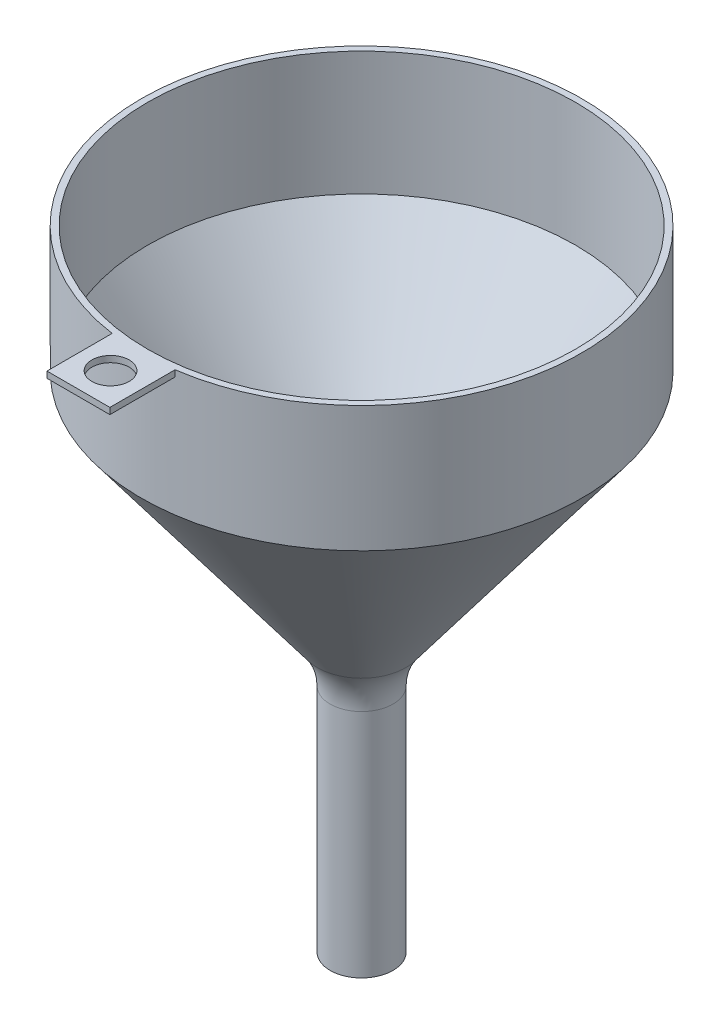
ISO-10303-21;
HEADER;
FILE_DESCRIPTION(('STEP AP214'),'2;1');
FILE_NAME('part.step','',(''),(''),'','','');
FILE_SCHEMA(('AUTOMOTIVE_DESIGN { 1 0 10303 214 1 1 1 1 }'));
ENDSEC;
DATA;
#1=APPLICATION_CONTEXT('core data for automotive mechanical design processes');
#2=APPLICATION_PROTOCOL_DEFINITION('international standard','automotive_design',2000,#1);
#3=PRODUCT_CONTEXT('',#1,'mechanical');
#4=PRODUCT('Part','Part','',(#3));
#5=PRODUCT_RELATED_PRODUCT_CATEGORY('part','',(#4));
#6=PRODUCT_DEFINITION_FORMATION('','',#4);
#7=PRODUCT_DEFINITION_CONTEXT('part definition',#1,'design');
#8=PRODUCT_DEFINITION('design','',#6,#7);
#9=PRODUCT_DEFINITION_SHAPE('','',#8);
#10=(LENGTH_UNIT() NAMED_UNIT(*) SI_UNIT(.MILLI.,.METRE.));
#11=(NAMED_UNIT(*) PLANE_ANGLE_UNIT() SI_UNIT($,.RADIAN.));
#12=(NAMED_UNIT(*) SI_UNIT($,.STERADIAN.) SOLID_ANGLE_UNIT());
#13=UNCERTAINTY_MEASURE_WITH_UNIT(LENGTH_MEASURE(1.E-05),#10,'distance_accuracy_value','');
#14=(GEOMETRIC_REPRESENTATION_CONTEXT(3) GLOBAL_UNCERTAINTY_ASSIGNED_CONTEXT((#13)) GLOBAL_UNIT_ASSIGNED_CONTEXT((#10,
#11,#12)) REPRESENTATION_CONTEXT('',''));
#15=CARTESIAN_POINT('',(0.,0.,0.));
#16=DIRECTION('',(0.,0.,1.));
#17=DIRECTION('',(1.,0.,0.));
#18=AXIS2_PLACEMENT_3D('',#15,#16,#17);
#19=CARTESIAN_POINT('',(0.,-18.8,0.));
#20=DIRECTION('',(0.,1.,0.));
#21=DIRECTION('',(-1.,0.,0.));
#22=AXIS2_PLACEMENT_3D('',#19,#20,#21);
#23=CONICAL_SURFACE('',#22,8.39999999999996,0.643501108793285);
#24=CARTESIAN_POINT('',(0.,60.6666666666667,0.));
#25=DIRECTION('',(0.,1.,0.));
#26=DIRECTION('',(-1.,0.,0.));
#27=AXIS2_PLACEMENT_3D('',#24,#25,#26);
#28=CIRCLE('',#27,68.);
#29=CARTESIAN_POINT('',(-68.,60.6666666666667,0.));
#30=VERTEX_POINT('',#29);
#31=EDGE_CURVE('E112',#30,#30,#28,.T.);
#32=CARTESIAN_POINT('',(0.,-18.,0.));
#33=DIRECTION('',(0.,-1.,0.));
#34=DIRECTION('',(1.,0.,0.));
#35=AXIS2_PLACEMENT_3D('',#32,#33,#34);
#36=CIRCLE('',#35,8.99999999999996);
#37=CARTESIAN_POINT('',(-8.99999999999996,-18.,0.));
#38=VERTEX_POINT('',#37);
#39=EDGE_CURVE('E129',#38,#38,#36,.T.);
#40=CARTESIAN_POINT('',(-68.,60.6666666666667,0.));
#41=CARTESIAN_POINT('',(-67.3854166666667,59.8472222222222,0.));
#42=CARTESIAN_POINT('',(-66.7708333333333,59.0277777777778,0.));
#43=CARTESIAN_POINT('',(-65.5416666666667,57.3888888888889,0.));
#44=CARTESIAN_POINT('',(-64.9270833333333,56.5694444444445,0.));
#45=CARTESIAN_POINT('',(-63.6979166666667,54.9305555555556,0.));
#46=CARTESIAN_POINT('',(-63.0833333333333,54.1111111111111,0.));
#47=CARTESIAN_POINT('',(-61.8541666666667,52.4722222222222,0.));
#48=CARTESIAN_POINT('',(-61.2395833333333,51.6527777777778,0.));
#49=CARTESIAN_POINT('',(-60.0104166666667,50.0138888888889,0.));
#50=CARTESIAN_POINT('',(-59.3958333333333,49.1944444444445,0.));
#51=CARTESIAN_POINT('',(-58.1666666666667,47.5555555555556,0.));
#52=CARTESIAN_POINT('',(-57.5520833333333,46.7361111111111,0.));
#53=CARTESIAN_POINT('',(-56.3229166666667,45.0972222222222,0.));
#54=CARTESIAN_POINT('',(-55.7083333333333,44.2777777777778,0.));
#55=CARTESIAN_POINT('',(-54.4791666666667,42.6388888888889,0.));
#56=CARTESIAN_POINT('',(-53.8645833333333,41.8194444444444,0.));
#57=CARTESIAN_POINT('',(-52.6354166666667,40.1805555555556,0.));
#58=CARTESIAN_POINT('',(-52.0208333333333,39.3611111111111,0.));
#59=CARTESIAN_POINT('',(-50.7916666666667,37.7222222222222,0.));
#60=CARTESIAN_POINT('',(-50.1770833333333,36.9027777777778,0.));
#61=CARTESIAN_POINT('',(-48.9479166666667,35.2638888888889,0.));
#62=CARTESIAN_POINT('',(-48.3333333333333,34.4444444444444,0.));
#63=CARTESIAN_POINT('',(-47.1041666666667,32.8055555555556,0.));
#64=CARTESIAN_POINT('',(-46.4895833333333,31.9861111111111,0.));
#65=CARTESIAN_POINT('',(-45.2604166666667,30.3472222222222,0.));
#66=CARTESIAN_POINT('',(-44.6458333333333,29.5277777777778,0.));
#67=CARTESIAN_POINT('',(-43.4166666666667,27.8888888888889,0.));
#68=CARTESIAN_POINT('',(-42.8020833333333,27.0694444444444,0.));
#69=CARTESIAN_POINT('',(-41.5729166666667,25.4305555555556,0.));
#70=CARTESIAN_POINT('',(-40.9583333333333,24.6111111111111,0.));
#71=CARTESIAN_POINT('',(-39.7291666666667,22.9722222222222,0.));
#72=CARTESIAN_POINT('',(-39.1145833333333,22.1527777777778,0.));
#73=CARTESIAN_POINT('',(-37.8854166666666,20.5138888888889,0.));
#74=CARTESIAN_POINT('',(-37.2708333333333,19.6944444444444,0.));
#75=CARTESIAN_POINT('',(-36.0416666666666,18.0555555555556,0.));
#76=CARTESIAN_POINT('',(-35.4270833333333,17.2361111111111,0.));
#77=CARTESIAN_POINT('',(-34.1979166666667,15.5972222222222,0.));
#78=CARTESIAN_POINT('',(-33.5833333333333,14.7777777777778,0.));
#79=CARTESIAN_POINT('',(-32.3541666666666,13.1388888888889,0.));
#80=CARTESIAN_POINT('',(-31.7395833333333,12.3194444444444,0.));
#81=CARTESIAN_POINT('',(-30.5104166666666,10.6805555555556,0.));
#82=CARTESIAN_POINT('',(-29.8958333333333,9.86111111111111,0.));
#83=CARTESIAN_POINT('',(-28.6666666666666,8.22222222222222,0.));
#84=CARTESIAN_POINT('',(-28.0520833333333,7.40277777777777,0.));
#85=CARTESIAN_POINT('',(-26.8229166666666,5.76388888888889,0.));
#86=CARTESIAN_POINT('',(-26.2083333333333,4.94444444444444,0.));
#87=CARTESIAN_POINT('',(-24.9791666666666,3.30555555555555,0.));
#88=CARTESIAN_POINT('',(-24.3645833333333,2.48611111111111,0.));
#89=CARTESIAN_POINT('',(-23.1354166666666,0.847222222222218,0.));
#90=CARTESIAN_POINT('',(-22.5208333333333,0.0277777777777749,0.));
#91=CARTESIAN_POINT('',(-21.2916666666666,-1.61111111111112,0.));
#92=CARTESIAN_POINT('',(-20.6770833333333,-2.43055555555556,0.));
#93=CARTESIAN_POINT('',(-19.4479166666666,-4.06944444444445,0.));
#94=CARTESIAN_POINT('',(-18.8333333333333,-4.88888888888889,0.));
#95=CARTESIAN_POINT('',(-17.6041666666666,-6.52777777777778,0.));
#96=CARTESIAN_POINT('',(-16.9895833333333,-7.34722222222223,0.));
#97=CARTESIAN_POINT('',(-15.7604166666666,-8.98611111111112,0.));
#98=CARTESIAN_POINT('',(-15.1458333333333,-9.80555555555556,0.));
#99=CARTESIAN_POINT('',(-13.9166666666666,-11.4444444444444,0.));
#100=CARTESIAN_POINT('',(-13.3020833333333,-12.2638888888889,0.));
#101=CARTESIAN_POINT('',(-12.0729166666666,-13.9027777777778,0.));
#102=CARTESIAN_POINT('',(-11.4583333333333,-14.7222222222222,0.));
#103=CARTESIAN_POINT('',(-10.2291666666666,-16.3611111111111,0.));
#104=CARTESIAN_POINT('',(-9.61458333333329,-17.1805555555556,0.));
#105=CARTESIAN_POINT('',(-8.99999999999996,-18.,0.));
#106=B_SPLINE_CURVE_WITH_KNOTS('',3,(#40,#41,#42,#43,#44,#45,#46,#47,#48,#49,#50,#51,#52,#53,
#54,#55,#56,#57,#58,#59,#60,#61,#62,#63,#64,#65,#66,#67,#68,#69,#70,#71,#72,#73,#74,#75,#76,#77,
#78,#79,#80,#81,#82,#83,#84,#85,#86,#87,#88,#89,#90,#91,#92,#93,#94,#95,#96,#97,#98,#99,#100,
#101,#102,#103,#104,#105),.UNSPECIFIED.,.F.,.F.,(4,2,2,2,2,2,2,2,2,2,2,2,2,2,2,2,2,2,2,2,2,2,2,
2,2,2,2,2,2,2,2,2,4),(0.,3.07291666666667,6.14583333333334,9.21875000000001,12.2916666666667,
15.3645833333333,18.4375,21.5104166666667,24.5833333333333,27.65625,30.7291666666667,
33.8020833333333,36.875,39.9479166666667,43.0208333333334,46.09375,49.1666666666667,
52.2395833333334,55.3125,58.3854166666667,61.4583333333334,64.53125,67.6041666666667,
70.6770833333334,73.75,76.8229166666667,79.8958333333334,82.96875,86.0416666666667,
89.1145833333334,92.1875,95.2604166666667,98.3333333333334),.UNSPECIFIED.);
#107=EDGE_CURVE('BSEAM35',#30,#38,#106,.T.);
#108=ORIENTED_EDGE('',*,*,#31,.T.);
#109=ORIENTED_EDGE('',*,*,#39,.T.);
#110=ORIENTED_EDGE('',*,*,#107,.T.);
#111=ORIENTED_EDGE('',*,*,#107,.F.);
#112=EDGE_LOOP('',(#108,#110,#109,#111));
#113=FACE_BOUND('',#112,.T.);
#114=ADVANCED_FACE('F35',(#113),#23,.F.);
#115=CARTESIAN_POINT('',(0.,100.,0.));
#116=DIRECTION('',(0.,1.,0.));
#117=DIRECTION('',(-1.,0.,0.));
#118=AXIS2_PLACEMENT_3D('',#115,#116,#117);
#119=CYLINDRICAL_SURFACE('',#118,70.);
#120=CARTESIAN_POINT('',(0.,60.,0.));
#121=DIRECTION('',(0.,1.,0.));
#122=DIRECTION('',(-1.,0.,0.));
#123=AXIS2_PLACEMENT_3D('',#120,#121,#122);
#124=CIRCLE('',#123,70.);
#125=CARTESIAN_POINT('',(-70.,60.,0.));
#126=VERTEX_POINT('',#125);
#127=EDGE_CURVE('E123',#126,#126,#124,.T.);
#128=ORIENTED_EDGE('',*,*,#127,.T.);
#129=EDGE_LOOP('',(#128));
#130=FACE_BOUND('',#129,.T.);
#131=DIRECTION('',(0.,1.,0.));
#132=VECTOR('',#131,1.);
#133=CARTESIAN_POINT('',(9.99999999999999,98.,69.2820323027551));
#134=LINE('',#133,#132);
#135=CARTESIAN_POINT('',(9.99999999999999,98.,69.2820323027551));
#136=VERTEX_POINT('',#135);
#137=CARTESIAN_POINT('',(9.99999999999999,100.,69.2820323027551));
#138=VERTEX_POINT('',#137);
#139=EDGE_CURVE('E50',#136,#138,#134,.T.);
#140=ORIENTED_EDGE('',*,*,#139,.F.);
#141=CARTESIAN_POINT('',(0.,98.,0.));
#142=DIRECTION('',(0.,1.,0.));
#143=DIRECTION('',(0.,0.,1.));
#144=AXIS2_PLACEMENT_3D('',#141,#142,#143);
#145=CIRCLE('',#144,70.);
#146=CARTESIAN_POINT('',(-10.,98.,69.2820323027551));
#147=VERTEX_POINT('',#146);
#148=EDGE_CURVE('E97',#147,#136,#145,.T.);
#149=ORIENTED_EDGE('',*,*,#148,.F.);
#150=DIRECTION('',(0.,1.,0.));
#151=VECTOR('',#150,1.);
#152=CARTESIAN_POINT('',(-10.,98.,69.2820323027551));
#153=LINE('',#152,#151);
#154=CARTESIAN_POINT('',(-10.,100.,69.2820323027551));
#155=VERTEX_POINT('',#154);
#156=EDGE_CURVE('E76',#147,#155,#153,.T.);
#157=ORIENTED_EDGE('',*,*,#156,.T.);
#158=CARTESIAN_POINT('',(0.,100.,0.));
#159=DIRECTION('',(0.,1.,0.));
#160=DIRECTION('',(-1.,0.,0.));
#161=AXIS2_PLACEMENT_3D('',#158,#159,#160);
#162=CIRCLE('',#161,70.);
#163=EDGE_CURVE('E120',#138,#155,#162,.T.);
#164=ORIENTED_EDGE('',*,*,#163,.F.);
#165=EDGE_LOOP('',(#140,#149,#157,#164));
#166=FACE_BOUND('',#165,.T.);
#167=ADVANCED_FACE('F149',(#130,#166),#119,.T.);
#168=CARTESIAN_POINT('',(0.,-20.,0.));
#169=DIRECTION('',(0.,1.,0.));
#170=DIRECTION('',(-1.,0.,0.));
#171=AXIS2_PLACEMENT_3D('',#168,#169,#170);
#172=CONICAL_SURFACE('',#171,9.99999999999996,0.643501108793285);
#173=CARTESIAN_POINT('',(0.,-14.6666666666666,0.));
#174=DIRECTION('',(0.,1.,0.));
#175=DIRECTION('',(-1.,0.,0.));
#176=AXIS2_PLACEMENT_3D('',#173,#174,#175);
#177=CIRCLE('',#176,14.);
#178=CARTESIAN_POINT('',(-14.,-14.6666666666666,0.));
#179=VERTEX_POINT('',#178);
#180=EDGE_CURVE('E43',#179,#179,#177,.T.);
#181=CARTESIAN_POINT('',(-14.,-14.6666666666666,0.));
#182=CARTESIAN_POINT('',(-14.5833333333333,-13.8888888888889,0.));
#183=CARTESIAN_POINT('',(-15.1666666666666,-13.1111111111111,0.));
#184=CARTESIAN_POINT('',(-16.3333333333333,-11.5555555555555,0.));
#185=CARTESIAN_POINT('',(-16.9166666666666,-10.7777777777778,0.));
#186=CARTESIAN_POINT('',(-18.0833333333333,-9.22222222222221,0.));
#187=CARTESIAN_POINT('',(-18.6666666666666,-8.44444444444443,0.));
#188=CARTESIAN_POINT('',(-19.8333333333333,-6.88888888888887,0.));
#189=CARTESIAN_POINT('',(-20.4166666666666,-6.11111111111109,0.));
#190=CARTESIAN_POINT('',(-21.5833333333333,-4.55555555555554,0.));
#191=CARTESIAN_POINT('',(-22.1666666666666,-3.77777777777776,0.));
#192=CARTESIAN_POINT('',(-23.3333333333333,-2.2222222222222,0.));
#193=CARTESIAN_POINT('',(-23.9166666666667,-1.44444444444443,0.));
#194=CARTESIAN_POINT('',(-25.0833333333333,0.111111111111129,0.));
#195=CARTESIAN_POINT('',(-25.6666666666667,0.888888888888906,0.));
#196=CARTESIAN_POINT('',(-26.8333333333333,2.44444444444446,0.));
#197=CARTESIAN_POINT('',(-27.4166666666667,3.22222222222224,0.));
#198=CARTESIAN_POINT('',(-28.5833333333333,4.7777777777778,0.));
#199=CARTESIAN_POINT('',(-29.1666666666667,5.55555555555557,0.));
#200=CARTESIAN_POINT('',(-30.3333333333333,7.11111111111113,0.));
#201=CARTESIAN_POINT('',(-30.9166666666667,7.88888888888891,0.));
#202=CARTESIAN_POINT('',(-32.0833333333333,9.44444444444446,0.));
#203=CARTESIAN_POINT('',(-32.6666666666667,10.2222222222222,0.));
#204=CARTESIAN_POINT('',(-33.8333333333333,11.7777777777778,0.));
#205=CARTESIAN_POINT('',(-34.4166666666667,12.5555555555556,0.));
#206=CARTESIAN_POINT('',(-35.5833333333333,14.1111111111111,0.));
#207=CARTESIAN_POINT('',(-36.1666666666667,14.8888888888889,0.));
#208=CARTESIAN_POINT('',(-37.3333333333333,16.4444444444445,0.));
#209=CARTESIAN_POINT('',(-37.9166666666667,17.2222222222222,0.));
#210=CARTESIAN_POINT('',(-39.0833333333333,18.7777777777778,0.));
#211=CARTESIAN_POINT('',(-39.6666666666667,19.5555555555556,0.));
#212=CARTESIAN_POINT('',(-40.8333333333333,21.1111111111111,0.));
#213=CARTESIAN_POINT('',(-41.4166666666667,21.8888888888889,0.));
#214=CARTESIAN_POINT('',(-42.5833333333333,23.4444444444445,0.));
#215=CARTESIAN_POINT('',(-43.1666666666667,24.2222222222222,0.));
#216=CARTESIAN_POINT('',(-44.3333333333333,25.7777777777778,0.));
#217=CARTESIAN_POINT('',(-44.9166666666667,26.5555555555556,0.));
#218=CARTESIAN_POINT('',(-46.0833333333333,28.1111111111111,0.));
#219=CARTESIAN_POINT('',(-46.6666666666667,28.8888888888889,0.));
#220=CARTESIAN_POINT('',(-47.8333333333333,30.4444444444445,0.));
#221=CARTESIAN_POINT('',(-48.4166666666667,31.2222222222222,0.));
#222=CARTESIAN_POINT('',(-49.5833333333333,32.7777777777778,0.));
#223=CARTESIAN_POINT('',(-50.1666666666667,33.5555555555556,0.));
#224=CARTESIAN_POINT('',(-51.3333333333333,35.1111111111111,0.));
#225=CARTESIAN_POINT('',(-51.9166666666667,35.8888888888889,0.));
#226=CARTESIAN_POINT('',(-53.0833333333333,37.4444444444445,0.));
#227=CARTESIAN_POINT('',(-53.6666666666667,38.2222222222222,0.));
#228=CARTESIAN_POINT('',(-54.8333333333333,39.7777777777778,0.));
#229=CARTESIAN_POINT('',(-55.4166666666667,40.5555555555556,0.));
#230=CARTESIAN_POINT('',(-56.5833333333333,42.1111111111111,0.));
#231=CARTESIAN_POINT('',(-57.1666666666667,42.8888888888889,0.));
#232=CARTESIAN_POINT('',(-58.3333333333333,44.4444444444444,0.));
#233=CARTESIAN_POINT('',(-58.9166666666667,45.2222222222222,0.));
#234=CARTESIAN_POINT('',(-60.0833333333333,46.7777777777778,0.));
#235=CARTESIAN_POINT('',(-60.6666666666667,47.5555555555556,0.));
#236=CARTESIAN_POINT('',(-61.8333333333333,49.1111111111111,0.));
#237=CARTESIAN_POINT('',(-62.4166666666667,49.8888888888889,0.));
#238=CARTESIAN_POINT('',(-63.5833333333333,51.4444444444444,0.));
#239=CARTESIAN_POINT('',(-64.1666666666667,52.2222222222222,0.));
#240=CARTESIAN_POINT('',(-65.3333333333333,53.7777777777778,0.));
#241=CARTESIAN_POINT('',(-65.9166666666667,54.5555555555556,0.));
#242=CARTESIAN_POINT('',(-67.0833333333333,56.1111111111111,0.));
#243=CARTESIAN_POINT('',(-67.6666666666667,56.8888888888889,0.));
#244=CARTESIAN_POINT('',(-68.8333333333333,58.4444444444445,0.));
#245=CARTESIAN_POINT('',(-69.4166666666667,59.2222222222222,0.));
#246=CARTESIAN_POINT('',(-70.,60.,0.));
#247=B_SPLINE_CURVE_WITH_KNOTS('',3,(#181,#182,#183,#184,#185,#186,#187,#188,#189,#190,#191,
#192,#193,#194,#195,#196,#197,#198,#199,#200,#201,#202,#203,#204,#205,#206,#207,#208,#209,#210,
#211,#212,#213,#214,#215,#216,#217,#218,#219,#220,#221,#222,#223,#224,#225,#226,#227,#228,#229,
#230,#231,#232,#233,#234,#235,#236,#237,#238,#239,#240,#241,#242,#243,#244,#245,#246),
.UNSPECIFIED.,.F.,.F.,(4,2,2,2,2,2,2,2,2,2,2,2,2,2,2,2,2,2,2,2,2,2,2,2,2,2,2,2,2,2,2,2,4),(0.,
2.91666666666667,5.83333333333333,8.75,11.6666666666667,14.5833333333333,17.5,20.4166666666667,
23.3333333333333,26.25,29.1666666666667,32.0833333333333,35.,37.9166666666667,40.8333333333333,
43.75,46.6666666666667,49.5833333333333,52.5,55.4166666666667,58.3333333333333,61.25,
64.1666666666666,67.0833333333333,70.,72.9166666666666,75.8333333333333,78.75,81.6666666666667,
84.5833333333333,87.5,90.4166666666667,93.3333333333334),.UNSPECIFIED.);
#248=EDGE_CURVE('BSEAM135',#179,#126,#247,.T.);
#249=ORIENTED_EDGE('',*,*,#180,.T.);
#250=ORIENTED_EDGE('',*,*,#127,.F.);
#251=ORIENTED_EDGE('',*,*,#248,.T.);
#252=ORIENTED_EDGE('',*,*,#248,.F.);
#253=EDGE_LOOP('',(#249,#251,#250,#252));
#254=FACE_BOUND('',#253,.T.);
#255=ADVANCED_FACE('F135',(#254),#172,.T.);
#256=CARTESIAN_POINT('',(0.,100.,0.));
#257=DIRECTION('',(0.,-1.,0.));
#258=DIRECTION('',(1.,0.,0.));
#259=AXIS2_PLACEMENT_3D('',#256,#257,#258);
#260=PLANE('',#259);
#261=CARTESIAN_POINT('',(0.,100.,79.7957849008974));
#262=DIRECTION('',(0.,1.,0.));
#263=DIRECTION('',(-1.,0.,0.));
#264=AXIS2_PLACEMENT_3D('',#261,#262,#263);
#265=CIRCLE('',#264,5.93165310772506);
#266=CARTESIAN_POINT('',(-5.93165310772506,100.,79.7957849008974));
#267=VERTEX_POINT('',#266);
#268=EDGE_CURVE('E128',#267,#267,#265,.T.);
#269=ORIENTED_EDGE('',*,*,#268,.F.);
#270=EDGE_LOOP('',(#269));
#271=FACE_BOUND('',#270,.T.);
#272=CARTESIAN_POINT('',(0.,100.,0.));
#273=DIRECTION('',(0.,-1.,0.));
#274=DIRECTION('',(1.,0.,0.));
#275=AXIS2_PLACEMENT_3D('',#272,#273,#274);
#276=CIRCLE('',#275,68.);
#277=CARTESIAN_POINT('',(68.,100.,0.));
#278=VERTEX_POINT('',#277);
#279=EDGE_CURVE('E109',#278,#278,#276,.F.);
#280=ORIENTED_EDGE('',*,*,#279,.F.);
#281=EDGE_LOOP('',(#280));
#282=FACE_BOUND('',#281,.T.);
#283=ORIENTED_EDGE('',*,*,#163,.T.);
#284=DIRECTION('',(0.,0.,1.));
#285=VECTOR('',#284,1.);
#286=CARTESIAN_POINT('',(-10.,100.,0.));
#287=LINE('',#286,#285);
#288=CARTESIAN_POINT('',(-10.,100.,90.));
#289=VERTEX_POINT('',#288);
#290=EDGE_CURVE('E103',#155,#289,#287,.T.);
#291=ORIENTED_EDGE('',*,*,#290,.T.);
#292=DIRECTION('',(-1.,0.,0.));
#293=VECTOR('',#292,1.);
#294=CARTESIAN_POINT('',(0.,100.,90.));
#295=LINE('',#294,#293);
#296=CARTESIAN_POINT('',(10.,100.,90.));
#297=VERTEX_POINT('',#296);
#298=EDGE_CURVE('E92',#297,#289,#295,.T.);
#299=ORIENTED_EDGE('',*,*,#298,.F.);
#300=DIRECTION('',(0.,0.,1.));
#301=VECTOR('',#300,1.);
#302=CARTESIAN_POINT('',(9.99999999999996,100.,0.));
#303=LINE('',#302,#301);
#304=EDGE_CURVE('E69',#138,#297,#303,.T.);
#305=ORIENTED_EDGE('',*,*,#304,.F.);
#306=EDGE_LOOP('',(#283,#291,#299,#305));
#307=FACE_BOUND('',#306,.T.);
#308=ADVANCED_FACE('F173',(#271,#282,#307),#260,.F.);
#309=CARTESIAN_POINT('',(0.,-100.,0.));
#310=DIRECTION('',(0.,1.,0.));
#311=DIRECTION('',(-1.,0.,0.));
#312=AXIS2_PLACEMENT_3D('',#309,#310,#311);
#313=PLANE('',#312);
#314=CARTESIAN_POINT('',(0.,-100.,0.));
#315=DIRECTION('',(0.,-1.,0.));
#316=DIRECTION('',(1.,0.,0.));
#317=AXIS2_PLACEMENT_3D('',#314,#315,#316);
#318=CIRCLE('',#317,9.20623253347552);
#319=CARTESIAN_POINT('',(9.20623253347552,-100.,0.));
#320=VERTEX_POINT('',#319);
#321=EDGE_CURVE('E292',#320,#320,#318,.T.);
#322=ORIENTED_EDGE('',*,*,#321,.F.);
#323=EDGE_LOOP('',(#322));
#324=FACE_BOUND('',#323,.T.);
#325=CARTESIAN_POINT('',(0.,-100.,0.));
#326=DIRECTION('',(0.,1.,0.));
#327=DIRECTION('',(-1.,0.,0.));
#328=AXIS2_PLACEMENT_3D('',#325,#326,#327);
#329=CIRCLE('',#328,10.);
#330=CARTESIAN_POINT('',(-10.,-100.,0.));
#331=VERTEX_POINT('',#330);
#332=EDGE_CURVE('E115',#331,#331,#329,.T.);
#333=ORIENTED_EDGE('',*,*,#332,.F.);
#334=EDGE_LOOP('',(#333));
#335=FACE_BOUND('',#334,.T.);
#336=ADVANCED_FACE('F169',(#324,#335),#313,.F.);
#337=CARTESIAN_POINT('',(0.,100.,0.));
#338=DIRECTION('',(0.,1.,0.));
#339=DIRECTION('',(-1.,0.,0.));
#340=AXIS2_PLACEMENT_3D('',#337,#338,#339);
#341=CYLINDRICAL_SURFACE('',#340,9.99999999999998);
#342=CARTESIAN_POINT('',(0.,-26.6666666666666,0.));
#343=DIRECTION('',(0.,1.,0.));
#344=DIRECTION('',(-1.,0.,0.));
#345=AXIS2_PLACEMENT_3D('',#342,#343,#344);
#346=CIRCLE('',#345,9.99999999999998);
#347=CARTESIAN_POINT('',(-9.99999999999998,-26.6666666666666,0.));
#348=VERTEX_POINT('',#347);
#349=EDGE_CURVE('E11',#348,#348,#346,.F.);
#350=ORIENTED_EDGE('',*,*,#349,.T.);
#351=EDGE_LOOP('',(#350));
#352=FACE_BOUND('',#351,.T.);
#353=ORIENTED_EDGE('',*,*,#332,.T.);
#354=EDGE_LOOP('',(#353));
#355=FACE_BOUND('',#354,.T.);
#356=ADVANCED_FACE('F165',(#352,#355),#341,.T.);
#357=CARTESIAN_POINT('',(0.,100.,0.));
#358=DIRECTION('',(0.,1.,0.));
#359=DIRECTION('',(-1.,0.,0.));
#360=AXIS2_PLACEMENT_3D('',#357,#358,#359);
#361=CYLINDRICAL_SURFACE('',#360,68.);
#362=ORIENTED_EDGE('',*,*,#279,.T.);
#363=EDGE_LOOP('',(#362));
#364=FACE_BOUND('',#363,.T.);
#365=ORIENTED_EDGE('',*,*,#31,.F.);
#366=EDGE_LOOP('',(#365));
#367=FACE_BOUND('',#366,.T.);
#368=ADVANCED_FACE('F161',(#364,#367),#361,.F.);
#369=CARTESIAN_POINT('',(9.99999999999996,98.,0.));
#370=DIRECTION('',(-1.,0.,0.));
#371=DIRECTION('',(0.,0.,1.));
#372=AXIS2_PLACEMENT_3D('',#369,#370,#371);
#373=PLANE('',#372);
#374=ORIENTED_EDGE('',*,*,#304,.T.);
#375=DIRECTION('',(0.,1.,0.));
#376=VECTOR('',#375,1.);
#377=CARTESIAN_POINT('',(10.,98.,90.));
#378=LINE('',#377,#376);
#379=CARTESIAN_POINT('',(10.,98.,90.));
#380=VERTEX_POINT('',#379);
#381=EDGE_CURVE('E94',#380,#297,#378,.T.);
#382=ORIENTED_EDGE('',*,*,#381,.F.);
#383=DIRECTION('',(0.,0.,1.));
#384=VECTOR('',#383,1.);
#385=CARTESIAN_POINT('',(9.99999999999996,98.,0.));
#386=LINE('',#385,#384);
#387=EDGE_CURVE('E56',#136,#380,#386,.T.);
#388=ORIENTED_EDGE('',*,*,#387,.F.);
#389=ORIENTED_EDGE('',*,*,#139,.T.);
#390=EDGE_LOOP('',(#374,#382,#388,#389));
#391=FACE_BOUND('',#390,.T.);
#392=ADVANCED_FACE('F164',(#391),#373,.F.);
#393=CARTESIAN_POINT('',(0.,98.,90.));
#394=DIRECTION('',(0.,0.,-1.));
#395=DIRECTION('',(-1.,0.,0.));
#396=AXIS2_PLACEMENT_3D('',#393,#394,#395);
#397=PLANE('',#396);
#398=ORIENTED_EDGE('',*,*,#298,.T.);
#399=DIRECTION('',(0.,1.,0.));
#400=VECTOR('',#399,1.);
#401=CARTESIAN_POINT('',(-10.,98.,90.));
#402=LINE('',#401,#400);
#403=CARTESIAN_POINT('',(-10.,98.,90.));
#404=VERTEX_POINT('',#403);
#405=EDGE_CURVE('E89',#404,#289,#402,.T.);
#406=ORIENTED_EDGE('',*,*,#405,.F.);
#407=DIRECTION('',(-1.,0.,0.));
#408=VECTOR('',#407,1.);
#409=CARTESIAN_POINT('',(0.,98.,90.));
#410=LINE('',#409,#408);
#411=EDGE_CURVE('E81',#380,#404,#410,.T.);
#412=ORIENTED_EDGE('',*,*,#411,.F.);
#413=ORIENTED_EDGE('',*,*,#381,.T.);
#414=EDGE_LOOP('',(#398,#406,#412,#413));
#415=FACE_BOUND('',#414,.T.);
#416=ADVANCED_FACE('F90',(#415),#397,.F.);
#417=CARTESIAN_POINT('',(-10.,98.,0.));
#418=DIRECTION('',(-1.,0.,0.));
#419=DIRECTION('',(0.,0.,1.));
#420=AXIS2_PLACEMENT_3D('',#417,#418,#419);
#421=PLANE('',#420);
#422=ORIENTED_EDGE('',*,*,#290,.F.);
#423=ORIENTED_EDGE('',*,*,#156,.F.);
#424=DIRECTION('',(0.,0.,1.));
#425=VECTOR('',#424,1.);
#426=CARTESIAN_POINT('',(-10.,98.,0.));
#427=LINE('',#426,#425);
#428=EDGE_CURVE('E84',#147,#404,#427,.T.);
#429=ORIENTED_EDGE('',*,*,#428,.T.);
#430=ORIENTED_EDGE('',*,*,#405,.T.);
#431=EDGE_LOOP('',(#422,#423,#429,#430));
#432=FACE_BOUND('',#431,.T.);
#433=ADVANCED_FACE('F96',(#432),#421,.T.);
#434=CARTESIAN_POINT('',(0.,98.,0.));
#435=DIRECTION('',(0.,1.,0.));
#436=DIRECTION('',(0.,0.,1.));
#437=AXIS2_PLACEMENT_3D('',#434,#435,#436);
#438=PLANE('',#437);
#439=CARTESIAN_POINT('',(0.,98.,79.7957849008974));
#440=DIRECTION('',(0.,1.,0.));
#441=DIRECTION('',(0.,0.,1.));
#442=AXIS2_PLACEMENT_3D('',#439,#440,#441);
#443=CIRCLE('',#442,5.93165310772506);
#444=CARTESIAN_POINT('',(0.,98.,85.7274380086225));
#445=VERTEX_POINT('',#444);
#446=EDGE_CURVE('E105',#445,#445,#443,.T.);
#447=ORIENTED_EDGE('',*,*,#446,.T.);
#448=EDGE_LOOP('',(#447));
#449=FACE_BOUND('',#448,.T.);
#450=ORIENTED_EDGE('',*,*,#148,.T.);
#451=ORIENTED_EDGE('',*,*,#387,.T.);
#452=ORIENTED_EDGE('',*,*,#411,.T.);
#453=ORIENTED_EDGE('',*,*,#428,.F.);
#454=EDGE_LOOP('',(#450,#451,#452,#453));
#455=FACE_BOUND('',#454,.T.);
#456=ADVANCED_FACE('F83',(#449,#455),#438,.F.);
#457=CARTESIAN_POINT('',(0.,78.,79.7957849008974));
#458=DIRECTION('',(0.,1.,0.));
#459=DIRECTION('',(-1.,0.,0.));
#460=AXIS2_PLACEMENT_3D('',#457,#458,#459);
#461=CYLINDRICAL_SURFACE('',#460,5.93165310772506);
#462=ORIENTED_EDGE('',*,*,#268,.T.);
#463=EDGE_LOOP('',(#462));
#464=FACE_BOUND('',#463,.T.);
#465=ORIENTED_EDGE('',*,*,#446,.F.);
#466=EDGE_LOOP('',(#465));
#467=FACE_BOUND('',#466,.T.);
#468=ADVANCED_FACE('F222',(#464,#467),#461,.F.);
#469=CARTESIAN_POINT('',(0.,-18.,0.));
#470=DIRECTION('',(0.,-1.,0.));
#471=DIRECTION('',(1.,0.,0.));
#472=AXIS2_PLACEMENT_3D('',#469,#470,#471);
#473=CYLINDRICAL_SURFACE('',#472,9.20623253347552);
#474=CARTESIAN_POINT('',(0.,-18.,0.));
#475=DIRECTION('',(0.,-1.,0.));
#476=DIRECTION('',(1.,0.,0.));
#477=AXIS2_PLACEMENT_3D('',#474,#475,#476);
#478=CIRCLE('',#477,9.20623253347552);
#479=CARTESIAN_POINT('',(9.20623253347552,-18.,0.));
#480=VERTEX_POINT('',#479);
#481=EDGE_CURVE('E131',#480,#480,#478,.T.);
#482=ORIENTED_EDGE('',*,*,#481,.F.);
#483=EDGE_LOOP('',(#482));
#484=FACE_BOUND('',#483,.T.);
#485=ORIENTED_EDGE('',*,*,#321,.T.);
#486=EDGE_LOOP('',(#485));
#487=FACE_BOUND('',#486,.T.);
#488=ADVANCED_FACE('F144',(#484,#487),#473,.F.);
#489=CARTESIAN_POINT('',(0.,-18.,0.));
#490=DIRECTION('',(0.,-1.,0.));
#491=DIRECTION('',(1.,0.,0.));
#492=AXIS2_PLACEMENT_3D('',#489,#490,#491);
#493=PLANE('',#492);
#494=ORIENTED_EDGE('',*,*,#39,.F.);
#495=EDGE_LOOP('',(#494));
#496=FACE_BOUND('',#495,.T.);
#497=ORIENTED_EDGE('',*,*,#481,.T.);
#498=EDGE_LOOP('',(#497));
#499=FACE_BOUND('',#498,.T.);
#500=ADVANCED_FACE('F139',(#496,#499),#493,.T.);
#501=CARTESIAN_POINT('',(0.,-26.6666666666667,0.));
#502=DIRECTION('',(0.,1.,0.));
#503=DIRECTION('',(-1.,0.,0.));
#504=AXIS2_PLACEMENT_3D('',#501,#502,#503);
#505=TOROIDAL_SURFACE('',#504,30.,20.);
#506=ORIENTED_EDGE('',*,*,#349,.F.);
#507=EDGE_LOOP('',(#506));
#508=FACE_BOUND('',#507,.T.);
#509=ORIENTED_EDGE('',*,*,#180,.F.);
#510=EDGE_LOOP('',(#509));
#511=FACE_BOUND('',#510,.T.);
#512=ADVANCED_FACE('F37',(#508,#511),#505,.F.);
#513=CLOSED_SHELL('',(#114,#167,#255,#308,#336,#356,#368,#392,#416,#433,#456,#468,#488,#500,#512));
#514=MANIFOLD_SOLID_BREP('B2',#513);
#515=ADVANCED_BREP_SHAPE_REPRESENTATION('',(#18,#514),#14);
#516=SHAPE_DEFINITION_REPRESENTATION(#9,#515);
ENDSEC;
END-ISO-10303-21;
